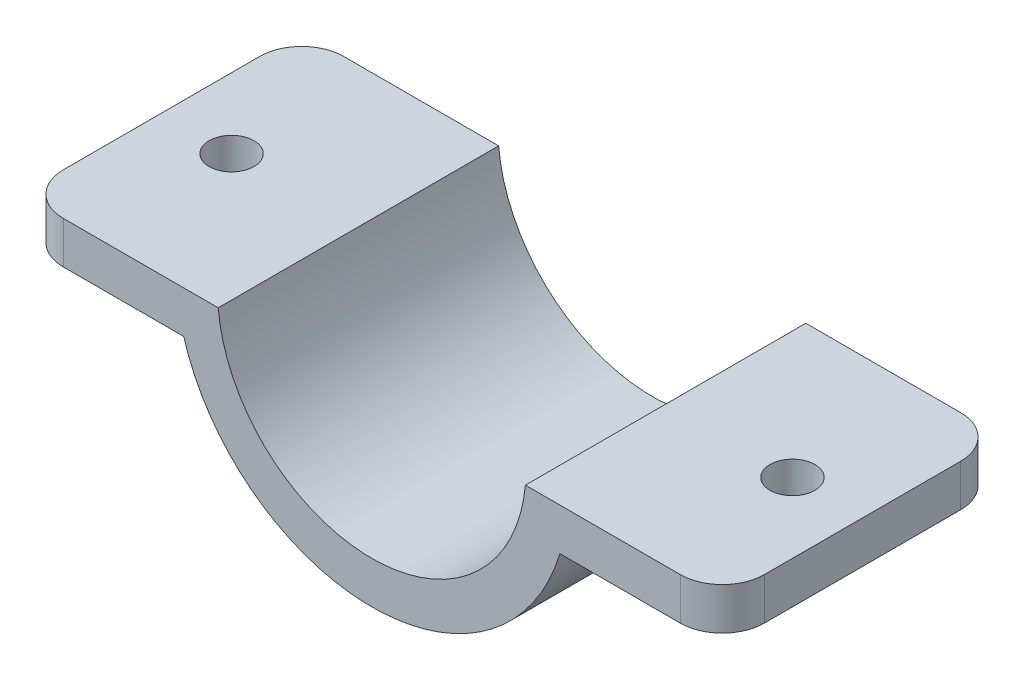
ISO-10303-21;
HEADER;
FILE_DESCRIPTION(('STEP AP214'),'2;1');
FILE_NAME('part.step','',(''),(''),'','','');
FILE_SCHEMA(('AUTOMOTIVE_DESIGN { 1 0 10303 214 1 1 1 1 }'));
ENDSEC;
DATA;
#1=APPLICATION_CONTEXT('core data for automotive mechanical design processes');
#2=APPLICATION_PROTOCOL_DEFINITION('international standard','automotive_design',2000,#1);
#3=PRODUCT_CONTEXT('',#1,'mechanical');
#4=PRODUCT('Part','Part','',(#3));
#5=PRODUCT_RELATED_PRODUCT_CATEGORY('part','',(#4));
#6=PRODUCT_DEFINITION_FORMATION('','',#4);
#7=PRODUCT_DEFINITION_CONTEXT('part definition',#1,'design');
#8=PRODUCT_DEFINITION('design','',#6,#7);
#9=PRODUCT_DEFINITION_SHAPE('','',#8);
#10=(LENGTH_UNIT() NAMED_UNIT(*) SI_UNIT(.MILLI.,.METRE.));
#11=(NAMED_UNIT(*) PLANE_ANGLE_UNIT() SI_UNIT($,.RADIAN.));
#12=(NAMED_UNIT(*) SI_UNIT($,.STERADIAN.) SOLID_ANGLE_UNIT());
#13=UNCERTAINTY_MEASURE_WITH_UNIT(LENGTH_MEASURE(1.E-05),#10,'distance_accuracy_value','');
#14=(GEOMETRIC_REPRESENTATION_CONTEXT(3) GLOBAL_UNCERTAINTY_ASSIGNED_CONTEXT((#13)) GLOBAL_UNIT_ASSIGNED_CONTEXT((#10,
#11,#12)) REPRESENTATION_CONTEXT('',''));
#15=CARTESIAN_POINT('',(0.,0.,0.));
#16=DIRECTION('',(0.,0.,1.));
#17=DIRECTION('',(1.,0.,0.));
#18=AXIS2_PLACEMENT_3D('',#15,#16,#17);
#19=CARTESIAN_POINT('',(0.,0.,20.));
#20=DIRECTION('',(0.,0.,-1.));
#21=DIRECTION('',(-1.,0.,0.));
#22=AXIS2_PLACEMENT_3D('',#19,#20,#21);
#23=CYLINDRICAL_SURFACE('',#22,11.);
#24=CARTESIAN_POINT('',(0.,0.,0.));
#25=DIRECTION('',(0.,0.,1.));
#26=DIRECTION('',(1.,0.,0.));
#27=AXIS2_PLACEMENT_3D('',#24,#25,#26);
#28=CIRCLE('',#27,11.);
#29=CARTESIAN_POINT('',(-10.9544511501033,-1.,0.));
#30=VERTEX_POINT('',#29);
#31=CARTESIAN_POINT('',(10.9544511501033,-1.,0.));
#32=VERTEX_POINT('',#31);
#33=EDGE_CURVE('E141',#30,#32,#28,.T.);
#34=ORIENTED_EDGE('',*,*,#33,.F.);
#35=DIRECTION('',(0.,0.,-1.));
#36=VECTOR('',#35,1.);
#37=CARTESIAN_POINT('',(-10.9544511501033,-1.,20.));
#38=LINE('',#37,#36);
#39=CARTESIAN_POINT('',(-10.9544511501033,-1.,20.));
#40=VERTEX_POINT('',#39);
#41=EDGE_CURVE('E126',#40,#30,#38,.T.);
#42=ORIENTED_EDGE('',*,*,#41,.F.);
#43=CARTESIAN_POINT('',(0.,0.,20.));
#44=DIRECTION('',(0.,0.,1.));
#45=DIRECTION('',(1.,0.,0.));
#46=AXIS2_PLACEMENT_3D('',#43,#44,#45);
#47=CIRCLE('',#46,11.);
#48=CARTESIAN_POINT('',(10.9544511501033,-1.,20.));
#49=VERTEX_POINT('',#48);
#50=EDGE_CURVE('E134',#40,#49,#47,.T.);
#51=ORIENTED_EDGE('',*,*,#50,.T.);
#52=DIRECTION('',(0.,0.,-1.));
#53=VECTOR('',#52,1.);
#54=CARTESIAN_POINT('',(10.9544511501033,-1.,20.));
#55=LINE('',#54,#53);
#56=EDGE_CURVE('E171',#49,#32,#55,.T.);
#57=ORIENTED_EDGE('',*,*,#56,.T.);
#58=EDGE_LOOP('',(#34,#42,#51,#57));
#59=FACE_BOUND('',#58,.T.);
#60=ADVANCED_FACE('F35',(#59),#23,.F.);
#61=CARTESIAN_POINT('',(0.,-1.,20.));
#62=DIRECTION('',(0.,1.,0.));
#63=DIRECTION('',(0.,0.,1.));
#64=AXIS2_PLACEMENT_3D('',#61,#62,#63);
#65=PLANE('',#64);
#66=CARTESIAN_POINT('',(-20.,-1.,10.));
#67=DIRECTION('',(0.,1.,0.));
#68=DIRECTION('',(0.,0.,1.));
#69=AXIS2_PLACEMENT_3D('',#66,#67,#68);
#70=CIRCLE('',#69,1.6);
#71=CARTESIAN_POINT('',(-20.,-1.,11.6));
#72=VERTEX_POINT('',#71);
#73=EDGE_CURVE('E155',#72,#72,#70,.T.);
#74=ORIENTED_EDGE('',*,*,#73,.F.);
#75=EDGE_LOOP('',(#74));
#76=FACE_BOUND('',#75,.T.);
#77=DIRECTION('',(0.,0.,-1.));
#78=VECTOR('',#77,1.);
#79=CARTESIAN_POINT('',(-25.,-1.,20.));
#80=LINE('',#79,#78);
#81=CARTESIAN_POINT('',(-25.,-1.,17.));
#82=VERTEX_POINT('',#81);
#83=CARTESIAN_POINT('',(-25.,-1.,3.));
#84=VERTEX_POINT('',#83);
#85=EDGE_CURVE('E143',#82,#84,#80,.T.);
#86=ORIENTED_EDGE('',*,*,#85,.F.);
#87=CARTESIAN_POINT('',(-22.,-1.,17.));
#88=DIRECTION('',(0.,1.,0.));
#89=DIRECTION('',(0.,0.,1.));
#90=AXIS2_PLACEMENT_3D('',#87,#88,#89);
#91=CIRCLE('',#90,3.);
#92=CARTESIAN_POINT('',(-22.,-1.,20.));
#93=VERTEX_POINT('',#92);
#94=EDGE_CURVE('E11',#82,#93,#91,.T.);
#95=ORIENTED_EDGE('',*,*,#94,.T.);
#96=DIRECTION('',(1.,0.,0.));
#97=VECTOR('',#96,1.);
#98=CARTESIAN_POINT('',(0.,-1.,20.));
#99=LINE('',#98,#97);
#100=EDGE_CURVE('E123',#93,#40,#99,.T.);
#101=ORIENTED_EDGE('',*,*,#100,.T.);
#102=ORIENTED_EDGE('',*,*,#41,.T.);
#103=DIRECTION('',(1.,0.,0.));
#104=VECTOR('',#103,1.);
#105=CARTESIAN_POINT('',(0.,-1.,0.));
#106=LINE('',#105,#104);
#107=CARTESIAN_POINT('',(-22.,-1.,0.));
#108=VERTEX_POINT('',#107);
#109=EDGE_CURVE('E153',#108,#30,#106,.T.);
#110=ORIENTED_EDGE('',*,*,#109,.F.);
#111=CARTESIAN_POINT('',(-22.,-1.,3.));
#112=DIRECTION('',(0.,1.,0.));
#113=DIRECTION('',(0.,0.,1.));
#114=AXIS2_PLACEMENT_3D('',#111,#112,#113);
#115=CIRCLE('',#114,3.);
#116=EDGE_CURVE('E43',#108,#84,#115,.T.);
#117=ORIENTED_EDGE('',*,*,#116,.T.);
#118=EDGE_LOOP('',(#86,#95,#101,#102,#110,#117));
#119=FACE_BOUND('',#118,.T.);
#120=ADVANCED_FACE('F125',(#76,#119),#65,.T.);
#121=CARTESIAN_POINT('',(-25.,0.,20.));
#122=DIRECTION('',(1.,0.,0.));
#123=DIRECTION('',(0.,0.,-1.));
#124=AXIS2_PLACEMENT_3D('',#121,#122,#123);
#125=PLANE('',#124);
#126=DIRECTION('',(0.,0.,-1.));
#127=VECTOR('',#126,1.);
#128=CARTESIAN_POINT('',(-25.,-4.00000000000001,20.));
#129=LINE('',#128,#127);
#130=CARTESIAN_POINT('',(-25.,-4.00000000000001,17.));
#131=VERTEX_POINT('',#130);
#132=CARTESIAN_POINT('',(-25.,-4.00000000000001,3.));
#133=VERTEX_POINT('',#132);
#134=EDGE_CURVE('E185',#131,#133,#129,.T.);
#135=ORIENTED_EDGE('',*,*,#134,.F.);
#136=DIRECTION('',(0.,-1.,0.));
#137=VECTOR('',#136,1.);
#138=CARTESIAN_POINT('',(-25.,-1.,17.));
#139=LINE('',#138,#137);
#140=EDGE_CURVE('E56',#131,#82,#139,.F.);
#141=ORIENTED_EDGE('',*,*,#140,.T.);
#142=ORIENTED_EDGE('',*,*,#85,.T.);
#143=DIRECTION('',(0.,-1.,0.));
#144=VECTOR('',#143,1.);
#145=CARTESIAN_POINT('',(-25.,0.,3.));
#146=LINE('',#145,#144);
#147=EDGE_CURVE('E219',#84,#133,#146,.T.);
#148=ORIENTED_EDGE('',*,*,#147,.T.);
#149=EDGE_LOOP('',(#135,#141,#142,#148));
#150=FACE_BOUND('',#149,.T.);
#151=ADVANCED_FACE('F223',(#150),#125,.F.);
#152=CARTESIAN_POINT('',(0.,-4.00000000000001,20.));
#153=DIRECTION('',(0.,1.,0.));
#154=DIRECTION('',(0.,0.,1.));
#155=AXIS2_PLACEMENT_3D('',#152,#153,#154);
#156=PLANE('',#155);
#157=CARTESIAN_POINT('',(-20.,-4.00000000000001,10.));
#158=DIRECTION('',(0.,-1.,0.));
#159=DIRECTION('',(0.,0.,-1.));
#160=AXIS2_PLACEMENT_3D('',#157,#158,#159);
#161=CIRCLE('',#160,1.6);
#162=CARTESIAN_POINT('',(-20.,-4.00000000000001,8.4));
#163=VERTEX_POINT('',#162);
#164=EDGE_CURVE('E192',#163,#163,#161,.T.);
#165=ORIENTED_EDGE('',*,*,#164,.F.);
#166=EDGE_LOOP('',(#165));
#167=FACE_BOUND('',#166,.T.);
#168=DIRECTION('',(1.,0.,0.));
#169=VECTOR('',#168,1.);
#170=CARTESIAN_POINT('',(0.,-4.00000000000001,20.));
#171=LINE('',#170,#169);
#172=CARTESIAN_POINT('',(-22.,-4.00000000000001,20.));
#173=VERTEX_POINT('',#172);
#174=CARTESIAN_POINT('',(-13.4164078649987,-4.00000000000001,20.));
#175=VERTEX_POINT('',#174);
#176=EDGE_CURVE('E133',#173,#175,#171,.T.);
#177=ORIENTED_EDGE('',*,*,#176,.F.);
#178=CARTESIAN_POINT('',(-22.,-4.00000000000001,17.));
#179=DIRECTION('',(0.,1.,0.));
#180=DIRECTION('',(0.,0.,1.));
#181=AXIS2_PLACEMENT_3D('',#178,#179,#180);
#182=CIRCLE('',#181,3.);
#183=EDGE_CURVE('E217',#173,#131,#182,.F.);
#184=ORIENTED_EDGE('',*,*,#183,.T.);
#185=ORIENTED_EDGE('',*,*,#134,.T.);
#186=CARTESIAN_POINT('',(-22.,-4.00000000000001,3.));
#187=DIRECTION('',(0.,1.,0.));
#188=DIRECTION('',(0.,0.,1.));
#189=AXIS2_PLACEMENT_3D('',#186,#187,#188);
#190=CIRCLE('',#189,3.);
#191=CARTESIAN_POINT('',(-22.,-4.00000000000001,0.));
#192=VERTEX_POINT('',#191);
#193=EDGE_CURVE('E215',#133,#192,#190,.F.);
#194=ORIENTED_EDGE('',*,*,#193,.T.);
#195=DIRECTION('',(1.,0.,0.));
#196=VECTOR('',#195,1.);
#197=CARTESIAN_POINT('',(0.,-4.00000000000001,0.));
#198=LINE('',#197,#196);
#199=CARTESIAN_POINT('',(-13.4164078649987,-4.00000000000001,0.));
#200=VERTEX_POINT('',#199);
#201=EDGE_CURVE('E165',#192,#200,#198,.T.);
#202=ORIENTED_EDGE('',*,*,#201,.T.);
#203=DIRECTION('',(0.,0.,-1.));
#204=VECTOR('',#203,1.);
#205=CARTESIAN_POINT('',(-13.4164078649987,-4.00000000000001,20.));
#206=LINE('',#205,#204);
#207=EDGE_CURVE('E182',#175,#200,#206,.T.);
#208=ORIENTED_EDGE('',*,*,#207,.F.);
#209=EDGE_LOOP('',(#177,#184,#185,#194,#202,#208));
#210=FACE_BOUND('',#209,.T.);
#211=ADVANCED_FACE('F227',(#167,#210),#156,.F.);
#212=CARTESIAN_POINT('',(0.,0.,20.));
#213=DIRECTION('',(0.,0.,-1.));
#214=DIRECTION('',(-1.,0.,0.));
#215=AXIS2_PLACEMENT_3D('',#212,#213,#214);
#216=CYLINDRICAL_SURFACE('',#215,14.);
#217=CARTESIAN_POINT('',(0.,0.,0.));
#218=DIRECTION('',(0.,0.,1.));
#219=DIRECTION('',(1.,0.,0.));
#220=AXIS2_PLACEMENT_3D('',#217,#218,#219);
#221=CIRCLE('',#220,14.);
#222=CARTESIAN_POINT('',(13.4164078649987,-4.00000000000001,0.));
#223=VERTEX_POINT('',#222);
#224=EDGE_CURVE('E167',#200,#223,#221,.T.);
#225=ORIENTED_EDGE('',*,*,#224,.T.);
#226=DIRECTION('',(0.,0.,-1.));
#227=VECTOR('',#226,1.);
#228=CARTESIAN_POINT('',(13.4164078649987,-4.00000000000001,20.));
#229=LINE('',#228,#227);
#230=CARTESIAN_POINT('',(13.4164078649987,-4.00000000000001,20.));
#231=VERTEX_POINT('',#230);
#232=EDGE_CURVE('E179',#231,#223,#229,.T.);
#233=ORIENTED_EDGE('',*,*,#232,.F.);
#234=CARTESIAN_POINT('',(0.,0.,20.));
#235=DIRECTION('',(0.,0.,1.));
#236=DIRECTION('',(1.,0.,0.));
#237=AXIS2_PLACEMENT_3D('',#234,#235,#236);
#238=CIRCLE('',#237,14.);
#239=EDGE_CURVE('E159',#175,#231,#238,.T.);
#240=ORIENTED_EDGE('',*,*,#239,.F.);
#241=ORIENTED_EDGE('',*,*,#207,.T.);
#242=EDGE_LOOP('',(#225,#233,#240,#241));
#243=FACE_BOUND('',#242,.T.);
#244=ADVANCED_FACE('F236',(#243),#216,.T.);
#245=CARTESIAN_POINT('',(0.,-4.00000000000001,20.));
#246=DIRECTION('',(0.,-1.,0.));
#247=DIRECTION('',(0.,0.,-1.));
#248=AXIS2_PLACEMENT_3D('',#245,#246,#247);
#249=PLANE('',#248);
#250=CARTESIAN_POINT('',(20.,-4.00000000000001,10.));
#251=DIRECTION('',(0.,1.,0.));
#252=DIRECTION('',(0.,0.,-1.));
#253=AXIS2_PLACEMENT_3D('',#250,#251,#252);
#254=CIRCLE('',#253,1.6);
#255=CARTESIAN_POINT('',(20.,-4.00000000000001,8.4));
#256=VERTEX_POINT('',#255);
#257=EDGE_CURVE('E193',#256,#256,#254,.T.);
#258=ORIENTED_EDGE('',*,*,#257,.T.);
#259=EDGE_LOOP('',(#258));
#260=FACE_BOUND('',#259,.T.);
#261=DIRECTION('',(-1.,0.,0.));
#262=VECTOR('',#261,1.);
#263=CARTESIAN_POINT('',(0.,-4.00000000000001,0.));
#264=LINE('',#263,#262);
#265=CARTESIAN_POINT('',(22.,-4.00000000000001,0.));
#266=VERTEX_POINT('',#265);
#267=EDGE_CURVE('E151',#266,#223,#264,.T.);
#268=ORIENTED_EDGE('',*,*,#267,.F.);
#269=CARTESIAN_POINT('',(22.,-4.00000000000001,3.));
#270=DIRECTION('',(0.,-1.,0.));
#271=DIRECTION('',(0.,0.,-1.));
#272=AXIS2_PLACEMENT_3D('',#269,#270,#271);
#273=CIRCLE('',#272,3.);
#274=CARTESIAN_POINT('',(25.,-4.00000000000001,3.));
#275=VERTEX_POINT('',#274);
#276=EDGE_CURVE('E200',#266,#275,#273,.T.);
#277=ORIENTED_EDGE('',*,*,#276,.T.);
#278=DIRECTION('',(0.,0.,-1.));
#279=VECTOR('',#278,1.);
#280=CARTESIAN_POINT('',(25.,-4.00000000000001,20.));
#281=LINE('',#280,#279);
#282=CARTESIAN_POINT('',(25.,-4.00000000000001,17.));
#283=VERTEX_POINT('',#282);
#284=EDGE_CURVE('E176',#283,#275,#281,.T.);
#285=ORIENTED_EDGE('',*,*,#284,.F.);
#286=CARTESIAN_POINT('',(22.,-4.00000000000001,17.));
#287=DIRECTION('',(0.,-1.,0.));
#288=DIRECTION('',(0.,0.,-1.));
#289=AXIS2_PLACEMENT_3D('',#286,#287,#288);
#290=CIRCLE('',#289,3.);
#291=CARTESIAN_POINT('',(22.,-4.00000000000001,20.));
#292=VERTEX_POINT('',#291);
#293=EDGE_CURVE('E198',#283,#292,#290,.T.);
#294=ORIENTED_EDGE('',*,*,#293,.T.);
#295=DIRECTION('',(-1.,0.,0.));
#296=VECTOR('',#295,1.);
#297=CARTESIAN_POINT('',(0.,-4.00000000000001,20.));
#298=LINE('',#297,#296);
#299=EDGE_CURVE('E162',#292,#231,#298,.T.);
#300=ORIENTED_EDGE('',*,*,#299,.T.);
#301=ORIENTED_EDGE('',*,*,#232,.T.);
#302=EDGE_LOOP('',(#268,#277,#285,#294,#300,#301));
#303=FACE_BOUND('',#302,.T.);
#304=ADVANCED_FACE('F239',(#260,#303),#249,.T.);
#305=CARTESIAN_POINT('',(25.,0.,20.));
#306=DIRECTION('',(1.,0.,0.));
#307=DIRECTION('',(0.,0.,-1.));
#308=AXIS2_PLACEMENT_3D('',#305,#306,#307);
#309=PLANE('',#308);
#310=ORIENTED_EDGE('',*,*,#284,.T.);
#311=DIRECTION('',(0.,-1.,0.));
#312=VECTOR('',#311,1.);
#313=CARTESIAN_POINT('',(25.,-1.,3.));
#314=LINE('',#313,#312);
#315=CARTESIAN_POINT('',(25.,-1.,3.));
#316=VERTEX_POINT('',#315);
#317=EDGE_CURVE('E205',#275,#316,#314,.F.);
#318=ORIENTED_EDGE('',*,*,#317,.T.);
#319=DIRECTION('',(0.,0.,-1.));
#320=VECTOR('',#319,1.);
#321=CARTESIAN_POINT('',(25.,-1.,20.));
#322=LINE('',#321,#320);
#323=CARTESIAN_POINT('',(25.,-1.,17.));
#324=VERTEX_POINT('',#323);
#325=EDGE_CURVE('E173',#324,#316,#322,.T.);
#326=ORIENTED_EDGE('',*,*,#325,.F.);
#327=DIRECTION('',(0.,-1.,0.));
#328=VECTOR('',#327,1.);
#329=CARTESIAN_POINT('',(25.,0.,17.));
#330=LINE('',#329,#328);
#331=EDGE_CURVE('E202',#324,#283,#330,.T.);
#332=ORIENTED_EDGE('',*,*,#331,.T.);
#333=EDGE_LOOP('',(#310,#318,#326,#332));
#334=FACE_BOUND('',#333,.T.);
#335=ADVANCED_FACE('F251',(#334),#309,.T.);
#336=CARTESIAN_POINT('',(20.,-1.,10.));
#337=DIRECTION('',(0.,1.,0.));
#338=DIRECTION('',(0.,0.,1.));
#339=AXIS2_PLACEMENT_3D('',#336,#337,#338);
#340=CIRCLE('',#339,1.6);
#341=CARTESIAN_POINT('',(20.,-1.,11.6));
#342=VERTEX_POINT('',#341);
#343=EDGE_CURVE('E189',#342,#342,#340,.F.);
#344=ORIENTED_EDGE('',*,*,#343,.T.);
#345=EDGE_LOOP('',(#344));
#346=FACE_BOUND('',#345,.T.);
#347=ORIENTED_EDGE('',*,*,#325,.T.);
#348=CARTESIAN_POINT('',(22.,-1.,3.));
#349=DIRECTION('',(0.,1.,0.));
#350=DIRECTION('',(0.,0.,1.));
#351=AXIS2_PLACEMENT_3D('',#348,#349,#350);
#352=CIRCLE('',#351,3.);
#353=CARTESIAN_POINT('',(22.,-1.,0.));
#354=VERTEX_POINT('',#353);
#355=EDGE_CURVE('E209',#316,#354,#352,.T.);
#356=ORIENTED_EDGE('',*,*,#355,.T.);
#357=EDGE_CURVE('E148',#32,#354,#106,.T.);
#358=ORIENTED_EDGE('',*,*,#357,.F.);
#359=ORIENTED_EDGE('',*,*,#56,.F.);
#360=CARTESIAN_POINT('',(22.,-1.,20.));
#361=VERTEX_POINT('',#360);
#362=EDGE_CURVE('E136',#49,#361,#99,.T.);
#363=ORIENTED_EDGE('',*,*,#362,.T.);
#364=CARTESIAN_POINT('',(22.,-1.,17.));
#365=DIRECTION('',(0.,1.,0.));
#366=DIRECTION('',(0.,0.,1.));
#367=AXIS2_PLACEMENT_3D('',#364,#365,#366);
#368=CIRCLE('',#367,3.);
#369=EDGE_CURVE('E207',#361,#324,#368,.T.);
#370=ORIENTED_EDGE('',*,*,#369,.T.);
#371=EDGE_LOOP('',(#347,#356,#358,#359,#363,#370));
#372=FACE_BOUND('',#371,.T.);
#373=ADVANCED_FACE('F248',(#346,#372),#65,.T.);
#374=CARTESIAN_POINT('',(0.,0.,20.));
#375=DIRECTION('',(0.,0.,1.));
#376=DIRECTION('',(1.,0.,0.));
#377=AXIS2_PLACEMENT_3D('',#374,#375,#376);
#378=PLANE('',#377);
#379=ORIENTED_EDGE('',*,*,#299,.F.);
#380=DIRECTION('',(0.,-1.,0.));
#381=VECTOR('',#380,1.);
#382=CARTESIAN_POINT('',(22.,0.,20.));
#383=LINE('',#382,#381);
#384=EDGE_CURVE('E213',#292,#361,#383,.F.);
#385=ORIENTED_EDGE('',*,*,#384,.T.);
#386=ORIENTED_EDGE('',*,*,#362,.F.);
#387=ORIENTED_EDGE('',*,*,#50,.F.);
#388=ORIENTED_EDGE('',*,*,#100,.F.);
#389=DIRECTION('',(0.,-1.,0.));
#390=VECTOR('',#389,1.);
#391=CARTESIAN_POINT('',(-22.,-4.00000000000001,20.));
#392=LINE('',#391,#390);
#393=EDGE_CURVE('E211',#93,#173,#392,.T.);
#394=ORIENTED_EDGE('',*,*,#393,.T.);
#395=ORIENTED_EDGE('',*,*,#176,.T.);
#396=ORIENTED_EDGE('',*,*,#239,.T.);
#397=EDGE_LOOP('',(#379,#385,#386,#387,#388,#394,#395,#396));
#398=FACE_BOUND('',#397,.T.);
#399=ADVANCED_FACE('F146',(#398),#378,.T.);
#400=CARTESIAN_POINT('',(0.,0.,0.));
#401=DIRECTION('',(0.,0.,1.));
#402=DIRECTION('',(1.,0.,0.));
#403=AXIS2_PLACEMENT_3D('',#400,#401,#402);
#404=PLANE('',#403);
#405=ORIENTED_EDGE('',*,*,#357,.T.);
#406=DIRECTION('',(0.,-1.,0.));
#407=VECTOR('',#406,1.);
#408=CARTESIAN_POINT('',(22.,-4.00000000000001,0.));
#409=LINE('',#408,#407);
#410=EDGE_CURVE('E195',#354,#266,#409,.T.);
#411=ORIENTED_EDGE('',*,*,#410,.T.);
#412=ORIENTED_EDGE('',*,*,#267,.T.);
#413=ORIENTED_EDGE('',*,*,#224,.F.);
#414=ORIENTED_EDGE('',*,*,#201,.F.);
#415=DIRECTION('',(0.,-1.,0.));
#416=VECTOR('',#415,1.);
#417=CARTESIAN_POINT('',(-22.,0.,0.));
#418=LINE('',#417,#416);
#419=EDGE_CURVE('E142',#192,#108,#418,.F.);
#420=ORIENTED_EDGE('',*,*,#419,.T.);
#421=ORIENTED_EDGE('',*,*,#109,.T.);
#422=ORIENTED_EDGE('',*,*,#33,.T.);
#423=EDGE_LOOP('',(#405,#411,#412,#413,#414,#420,#421,#422));
#424=FACE_BOUND('',#423,.T.);
#425=ADVANCED_FACE('F258',(#424),#404,.F.);
#426=CARTESIAN_POINT('',(-20.,16.,10.));
#427=DIRECTION('',(0.,-1.,0.));
#428=DIRECTION('',(0.,0.,-1.));
#429=AXIS2_PLACEMENT_3D('',#426,#427,#428);
#430=CYLINDRICAL_SURFACE('',#429,1.6);
#431=ORIENTED_EDGE('',*,*,#73,.T.);
#432=EDGE_LOOP('',(#431));
#433=FACE_BOUND('',#432,.T.);
#434=ORIENTED_EDGE('',*,*,#164,.T.);
#435=EDGE_LOOP('',(#434));
#436=FACE_BOUND('',#435,.T.);
#437=ADVANCED_FACE('F307',(#433,#436),#430,.F.);
#438=CARTESIAN_POINT('',(20.,16.,10.));
#439=DIRECTION('',(0.,-1.,0.));
#440=DIRECTION('',(0.,0.,-1.));
#441=AXIS2_PLACEMENT_3D('',#438,#439,#440);
#442=CYLINDRICAL_SURFACE('',#441,1.6);
#443=ORIENTED_EDGE('',*,*,#343,.F.);
#444=EDGE_LOOP('',(#443));
#445=FACE_BOUND('',#444,.T.);
#446=ORIENTED_EDGE('',*,*,#257,.F.);
#447=EDGE_LOOP('',(#446));
#448=FACE_BOUND('',#447,.T.);
#449=ADVANCED_FACE('F276',(#445,#448),#442,.F.);
#450=CARTESIAN_POINT('',(22.,0.,3.));
#451=DIRECTION('',(0.,1.,0.));
#452=DIRECTION('',(0.,0.,1.));
#453=AXIS2_PLACEMENT_3D('',#450,#451,#452);
#454=CYLINDRICAL_SURFACE('',#453,3.);
#455=ORIENTED_EDGE('',*,*,#355,.F.);
#456=ORIENTED_EDGE('',*,*,#317,.F.);
#457=ORIENTED_EDGE('',*,*,#276,.F.);
#458=ORIENTED_EDGE('',*,*,#410,.F.);
#459=EDGE_LOOP('',(#455,#456,#457,#458));
#460=FACE_BOUND('',#459,.T.);
#461=ADVANCED_FACE('F254',(#460),#454,.T.);
#462=CARTESIAN_POINT('',(22.,0.,17.));
#463=DIRECTION('',(0.,-1.,0.));
#464=DIRECTION('',(0.,0.,-1.));
#465=AXIS2_PLACEMENT_3D('',#462,#463,#464);
#466=CYLINDRICAL_SURFACE('',#465,3.);
#467=ORIENTED_EDGE('',*,*,#369,.F.);
#468=ORIENTED_EDGE('',*,*,#384,.F.);
#469=ORIENTED_EDGE('',*,*,#293,.F.);
#470=ORIENTED_EDGE('',*,*,#331,.F.);
#471=EDGE_LOOP('',(#467,#468,#469,#470));
#472=FACE_BOUND('',#471,.T.);
#473=ADVANCED_FACE('F244',(#472),#466,.T.);
#474=CARTESIAN_POINT('',(-22.,0.,17.));
#475=DIRECTION('',(0.,1.,0.));
#476=DIRECTION('',(0.,0.,1.));
#477=AXIS2_PLACEMENT_3D('',#474,#475,#476);
#478=CYLINDRICAL_SURFACE('',#477,3.);
#479=ORIENTED_EDGE('',*,*,#94,.F.);
#480=ORIENTED_EDGE('',*,*,#140,.F.);
#481=ORIENTED_EDGE('',*,*,#183,.F.);
#482=ORIENTED_EDGE('',*,*,#393,.F.);
#483=EDGE_LOOP('',(#479,#480,#481,#482));
#484=FACE_BOUND('',#483,.T.);
#485=ADVANCED_FACE('F231',(#484),#478,.T.);
#486=CARTESIAN_POINT('',(-22.,0.,3.));
#487=DIRECTION('',(0.,-1.,0.));
#488=DIRECTION('',(0.,0.,-1.));
#489=AXIS2_PLACEMENT_3D('',#486,#487,#488);
#490=CYLINDRICAL_SURFACE('',#489,3.);
#491=ORIENTED_EDGE('',*,*,#116,.F.);
#492=ORIENTED_EDGE('',*,*,#419,.F.);
#493=ORIENTED_EDGE('',*,*,#193,.F.);
#494=ORIENTED_EDGE('',*,*,#147,.F.);
#495=EDGE_LOOP('',(#491,#492,#493,#494));
#496=FACE_BOUND('',#495,.T.);
#497=ADVANCED_FACE('F37',(#496),#490,.T.);
#498=CLOSED_SHELL('',(#60,#120,#151,#211,#244,#304,#335,#373,#399,#425,#437,#449,#461,#473,#485,#497));
#499=MANIFOLD_SOLID_BREP('B2',#498);
#500=ADVANCED_BREP_SHAPE_REPRESENTATION('',(#18,#499),#14);
#501=SHAPE_DEFINITION_REPRESENTATION(#9,#500);
ENDSEC;
END-ISO-10303-21;
